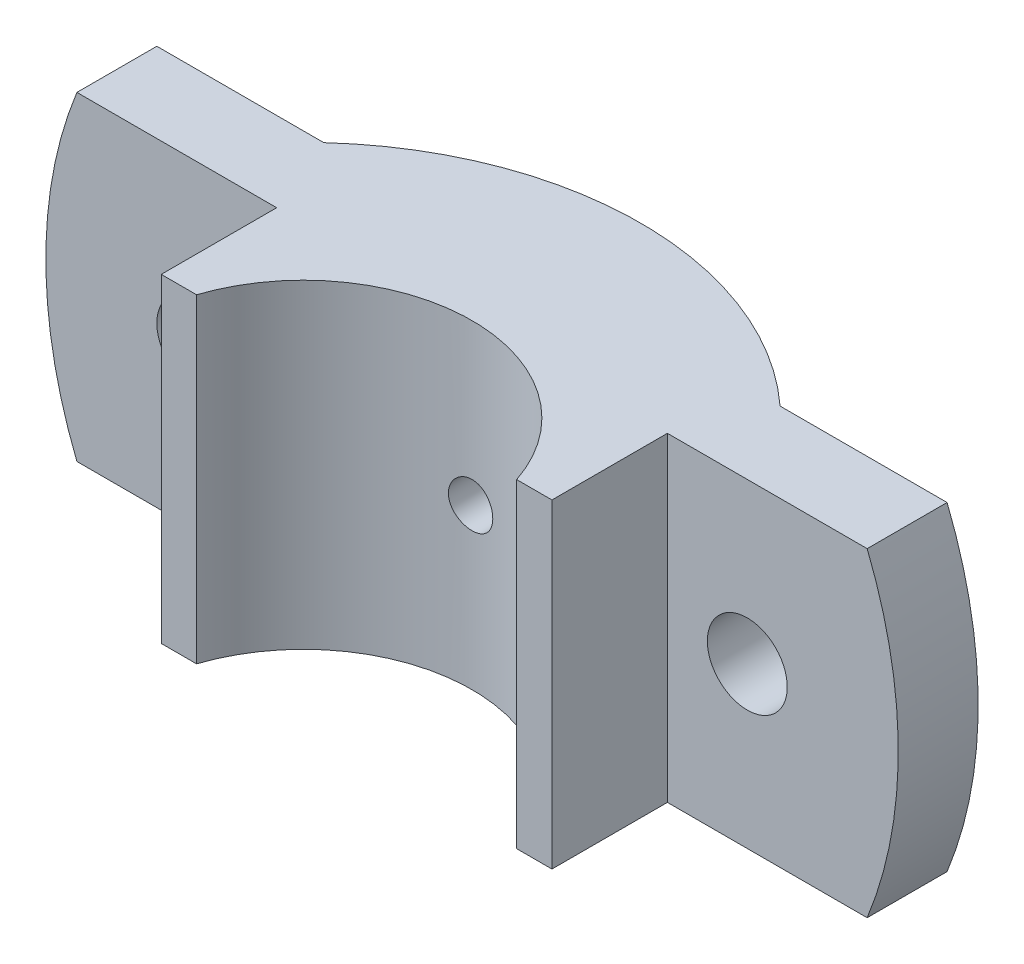
ISO-10303-21;
HEADER;
FILE_DESCRIPTION(('STEP AP214'),'2;1');
FILE_NAME('part.step','',(''),(''),'','','');
FILE_SCHEMA(('AUTOMOTIVE_DESIGN { 1 0 10303 214 1 1 1 1 }'));
ENDSEC;
DATA;
#1=APPLICATION_CONTEXT('core data for automotive mechanical design processes');
#2=APPLICATION_PROTOCOL_DEFINITION('international standard','automotive_design',2000,#1);
#3=PRODUCT_CONTEXT('',#1,'mechanical');
#4=PRODUCT('Part','Part','',(#3));
#5=PRODUCT_RELATED_PRODUCT_CATEGORY('part','',(#4));
#6=PRODUCT_DEFINITION_FORMATION('','',#4);
#7=PRODUCT_DEFINITION_CONTEXT('part definition',#1,'design');
#8=PRODUCT_DEFINITION('design','',#6,#7);
#9=PRODUCT_DEFINITION_SHAPE('','',#8);
#10=(LENGTH_UNIT() NAMED_UNIT(*) SI_UNIT(.MILLI.,.METRE.));
#11=(NAMED_UNIT(*) PLANE_ANGLE_UNIT() SI_UNIT($,.RADIAN.));
#12=(NAMED_UNIT(*) SI_UNIT($,.STERADIAN.) SOLID_ANGLE_UNIT());
#13=UNCERTAINTY_MEASURE_WITH_UNIT(LENGTH_MEASURE(1.E-05),#10,'distance_accuracy_value','');
#14=(GEOMETRIC_REPRESENTATION_CONTEXT(3) GLOBAL_UNCERTAINTY_ASSIGNED_CONTEXT((#13)) GLOBAL_UNIT_ASSIGNED_CONTEXT((#10,
#11,#12)) REPRESENTATION_CONTEXT('',''));
#15=CARTESIAN_POINT('',(0.,0.,0.));
#16=DIRECTION('',(0.,0.,1.));
#17=DIRECTION('',(1.,0.,0.));
#18=AXIS2_PLACEMENT_3D('',#15,#16,#17);
#19=CARTESIAN_POINT('',(0.,18.,0.));
#20=DIRECTION('',(0.,-1.,0.));
#21=DIRECTION('',(0.,0.,-1.));
#22=AXIS2_PLACEMENT_3D('',#19,#20,#21);
#23=CYLINDRICAL_SURFACE('',#22,38.);
#24=CARTESIAN_POINT('',(-2.99999999999999,0.,-37.8813938497516));
#25=CARTESIAN_POINT('',(-2.99999263785231,-0.168229356223722,-37.881395424836));
#26=CARTESIAN_POINT('',(-2.98580184849921,-0.336574006245494,-37.8825265582867));
#27=CARTESIAN_POINT('',(-2.92939974932901,-0.668607649957892,-37.8869289647691));
#28=CARTESIAN_POINT('',(-2.88715648723706,-0.832291112499561,-37.8902026781767));
#29=CARTESIAN_POINT('',(-2.77587681608235,-1.1501452237575,-37.8985171541647));
#30=CARTESIAN_POINT('',(-2.70685535144457,-1.30432112294824,-37.9035569309858));
#31=CARTESIAN_POINT('',(-2.54400458445207,-1.59886160168987,-37.9148344391245));
#32=CARTESIAN_POINT('',(-2.45018067379415,-1.73922917388467,-37.92107191));
#33=CARTESIAN_POINT('',(-2.24015280345187,-2.00253137226757,-37.9340582512773));
#34=CARTESIAN_POINT('',(-2.1239032815472,-2.12542960763649,-37.9408081455451));
#35=CARTESIAN_POINT('',(-1.87242010716811,-2.34999209013841,-37.9540493837728));
#36=CARTESIAN_POINT('',(-1.7371856346283,-2.45165541954577,-37.9605407165486));
#37=CARTESIAN_POINT('',(-1.45135636719248,-2.63098168610704,-37.9725429812434));
#38=CARTESIAN_POINT('',(-1.3007419119018,-2.708613379424,-37.9780526329515));
#39=CARTESIAN_POINT('',(-0.988565369760012,-2.83747282349098,-37.9874597537665));
#40=CARTESIAN_POINT('',(-0.82700345710322,-2.88870099425837,-37.9913572485189));
#41=CARTESIAN_POINT('',(-0.497878390626905,-2.96319512715381,-37.9970937704964));
#42=CARTESIAN_POINT('',(-0.330328567016737,-2.98651964678537,-37.998937107936));
#43=CARTESIAN_POINT('',(0.00631733654750822,-3.0047253592679,-38.0003722094706));
#44=CARTESIAN_POINT('',(0.17541339034767,-2.99960703233397,-37.9999640115795));
#45=CARTESIAN_POINT('',(0.509954787192964,-2.96112032248106,-37.9969456003133));
#46=CARTESIAN_POINT('',(0.67540742527791,-2.92781491240174,-37.9943402955467));
#47=CARTESIAN_POINT('',(0.998366668593192,-2.83399732705022,-37.9872264182713));
#48=CARTESIAN_POINT('',(1.1558732048081,-2.77348491551835,-37.9827178292348));
#49=CARTESIAN_POINT('',(1.45867002090717,-2.62690060373558,-37.9722962502068));
#50=CARTESIAN_POINT('',(1.6039465541759,-2.54080042217035,-37.9663817077167));
#51=CARTESIAN_POINT('',(1.87800944429183,-2.34550517866702,-37.9538131184224));
#52=CARTESIAN_POINT('',(2.00679550141832,-2.23630969705861,-37.9471590581814));
#53=CARTESIAN_POINT('',(2.24458971981856,-1.99756841972296,-37.9338380622355));
#54=CARTESIAN_POINT('',(2.35354296660022,-1.86796791907116,-37.9271711409281));
#55=CARTESIAN_POINT('',(2.54815472752467,-1.59228636571935,-37.9145941321889));
#56=CARTESIAN_POINT('',(2.63381322519709,-1.44620530136698,-37.9086840452923));
#57=CARTESIAN_POINT('',(2.77940144234371,-1.14167162060739,-37.8982886351211));
#58=CARTESIAN_POINT('',(2.83932843779762,-0.98321769646658,-37.8938034627057));
#59=CARTESIAN_POINT('',(2.93171253141031,-0.658454052626347,-37.8867684945926));
#60=CARTESIAN_POINT('',(2.96417014717686,-0.492144481013882,-37.8842186624274));
#61=CARTESIAN_POINT('',(3.00062486955394,-0.15687062958801,-37.8813488492975));
#62=CARTESIAN_POINT('',(3.00469849779479,0.0120852808075245,-37.8810228729924));
#63=CARTESIAN_POINT('',(2.98446993701008,0.348277674479457,-37.8826218486592));
#64=CARTESIAN_POINT('',(2.96016798514648,0.515514172114851,-37.884546781818));
#65=CARTESIAN_POINT('',(2.88394184726827,0.843301603254927,-37.8904252096708));
#66=CARTESIAN_POINT('',(2.83205326228916,1.00386086655318,-37.8943760896121));
#67=CARTESIAN_POINT('',(2.70216294400362,1.31399395677734,-37.9038590548662));
#68=CARTESIAN_POINT('',(2.62416083401247,1.46356762519929,-37.9093911629878));
#69=CARTESIAN_POINT('',(2.44406357833825,1.74783416137562,-37.9214277776749));
#70=CARTESIAN_POINT('',(2.34191737427746,1.88249459296493,-37.9279343341079));
#71=CARTESIAN_POINT('',(2.11650535947003,2.13278456634996,-37.9411797159946));
#72=CARTESIAN_POINT('',(1.99323922217928,2.24841381384239,-37.9479185450382));
#73=CARTESIAN_POINT('',(1.72875604909499,2.45761968980163,-37.9608869464052));
#74=CARTESIAN_POINT('',(1.58749965829181,2.55114664697588,-37.9671153515116));
#75=CARTESIAN_POINT('',(1.29124223392212,2.71315246287969,-37.9783443227055));
#76=CARTESIAN_POINT('',(1.13624132557013,2.78163154976985,-37.9833448999771));
#77=CARTESIAN_POINT('',(0.817073838218853,2.8915121915042,-37.9915493740706));
#78=CARTESIAN_POINT('',(0.652917946506941,2.93294463032733,-37.9947553195452));
#79=CARTESIAN_POINT('',(0.319953232508929,2.98765683143964,-37.999017594232));
#80=CARTESIAN_POINT('',(0.151144488421416,3.00093706657949,-38.0000739595491));
#81=CARTESIAN_POINT('',(-0.185844007724723,2.99896261174756,-37.9999181203354));
#82=CARTESIAN_POINT('',(-0.354024222061248,2.98378540562109,-37.9987120758837));
#83=CARTESIAN_POINT('',(-0.685439460070171,2.92548825985853,-37.9941791393791));
#84=CARTESIAN_POINT('',(-0.848674476485683,2.88236827921959,-37.9908522442141));
#85=CARTESIAN_POINT('',(-1.16557212517757,2.76942883565186,-37.9824510315142));
#86=CARTESIAN_POINT('',(-1.3192351758783,2.69961054075428,-37.9773767904253));
#87=CARTESIAN_POINT('',(-1.61267080850137,2.53526551305572,-37.9660490429656));
#88=CARTESIAN_POINT('',(-1.7524436427022,2.44073922912224,-37.9597955580186));
#89=CARTESIAN_POINT('',(-2.01452730784427,2.22937105364119,-37.9467913112364));
#90=CARTESIAN_POINT('',(-2.13679197870458,2.11247200370349,-37.9400393035084));
#91=CARTESIAN_POINT('',(-2.3600119308789,1.85977604977668,-37.926809547746));
#92=CARTESIAN_POINT('',(-2.46096203215627,1.72397456524185,-37.9203318666858));
#93=CARTESIAN_POINT('',(-2.63880908526894,1.43709086811672,-37.9083720300883));
#94=CARTESIAN_POINT('',(-2.71566430398236,1.28598273615028,-37.9028916086487));
#95=CARTESIAN_POINT('',(-2.84281465262269,0.973068347368229,-37.8935681492736));
#96=CARTESIAN_POINT('',(-2.89314045280836,0.811274688620423,-37.8897232215665));
#97=CARTESIAN_POINT('',(-2.9529242107747,0.540431663186952,-37.8850993601198));
#98=CARTESIAN_POINT('',(-2.97055431578336,0.433126408915519,-37.883716139462));
#99=CARTESIAN_POINT('',(-2.99409457369404,0.217230128113448,-37.8818628767795));
#100=CARTESIAN_POINT('',(-3.00000475432558,0.108639104625571,-37.8813928325941));
#101=CARTESIAN_POINT('',(-2.99999999999999,0.,-37.8813938497516));
#102=B_SPLINE_CURVE_WITH_KNOTS('',3,(#24,#25,#26,#27,#28,#29,#30,#31,#32,#33,#34,#35,#36,#37,
#38,#39,#40,#41,#42,#43,#44,#45,#46,#47,#48,#49,#50,#51,#52,#53,#54,#55,#56,#57,#58,#59,#60,#61,
#62,#63,#64,#65,#66,#67,#68,#69,#70,#71,#72,#73,#74,#75,#76,#77,#78,#79,#80,#81,#82,#83,#84,#85,
#86,#87,#88,#89,#90,#91,#92,#93,#94,#95,#96,#97,#98,#99,#100,#101),.UNSPECIFIED.,.T.,.F.,(4,2,2,
2,2,2,2,2,2,2,2,2,2,2,2,2,2,2,2,2,2,2,2,2,2,2,2,2,2,2,2,2,2,2,2,2,2,2,4),(0.,0.504291421669989,
1.00915822788302,1.51374368152856,2.01821953559138,2.52373134073237,3.02926498845646,
3.53545315301367,4.04163326507021,4.546749253583,5.05185671399058,5.55583868228782,
6.05982502713927,6.56437049631086,7.06892513448829,7.5748562462125,8.08078771565083,
8.58677273143866,9.09274821269729,9.59735908295554,10.1019657357268,10.6059227598395,
11.10988705379,11.6149267875576,12.1199743306602,12.6261463157288,13.1323136899712,
13.6379020669613,14.1434819519092,14.6476872439429,15.1518932758423,15.6560772516295,
16.1602520685946,16.6657325841807,17.1713358046312,17.6778099691558,18.1836973153047,
18.5093592531183,18.8350204204102),.UNSPECIFIED.);
#103=CARTESIAN_POINT('',(-2.99999999999999,0.,-37.8813938497516));
#104=VERTEX_POINT('',#103);
#105=EDGE_CURVE('E11',#104,#104,#102,.T.);
#106=ORIENTED_EDGE('',*,*,#105,.T.);
#107=EDGE_LOOP('',(#106));
#108=FACE_BOUND('',#107,.T.);
#109=DIRECTION('',(0.,-1.,0.));
#110=VECTOR('',#109,1.);
#111=CARTESIAN_POINT('',(25.6904651573303,18.,-28.));
#112=LINE('',#111,#110);
#113=CARTESIAN_POINT('',(25.6904651573303,18.,-28.));
#114=VERTEX_POINT('',#113);
#115=CARTESIAN_POINT('',(25.6904651573303,6.6376833123068,-28.));
#116=VERTEX_POINT('',#115);
#117=EDGE_CURVE('E148',#114,#116,#112,.T.);
#118=ORIENTED_EDGE('',*,*,#117,.T.);
#119=CARTESIAN_POINT('',(25.6904651573303,-6.63768331230681,-28.));
#120=CARTESIAN_POINT('',(25.5360851043424,-6.51420867249738,-28.1416681018721));
#121=CARTESIAN_POINT('',(25.3836215551735,-6.38340380017069,-28.2791823336498));
#122=CARTESIAN_POINT('',(25.0841053598261,-6.10685950724572,-28.5451833866574));
#123=CARTESIAN_POINT('',(24.9370580895264,-5.96110576476095,-28.6736613482156));
#124=CARTESIAN_POINT('',(24.6491941230388,-5.65349144226202,-28.9215085426632));
#125=CARTESIAN_POINT('',(24.508431723833,-5.49151942353941,-29.0408031542341));
#126=CARTESIAN_POINT('',(24.2363075607749,-5.15263687836671,-29.2682904084011));
#127=CARTESIAN_POINT('',(24.1049430857226,-4.97573069263073,-29.3764862568107));
#128=CARTESIAN_POINT('',(23.8528205053459,-4.60631493821574,-29.5815743674557));
#129=CARTESIAN_POINT('',(23.7321338833277,-4.41371469093336,-29.6783916917415));
#130=CARTESIAN_POINT('',(23.5043908446779,-4.01479632179466,-29.85908164754));
#131=CARTESIAN_POINT('',(23.3973358972541,-3.80847672492271,-29.942952883943));
#132=CARTESIAN_POINT('',(23.1992536300817,-3.38422419101506,-30.0966827286364));
#133=CARTESIAN_POINT('',(23.1081729651954,-3.16633319991272,-30.1665880882949));
#134=CARTESIAN_POINT('',(22.9434688496595,-2.72008092153076,-30.2920447623401));
#135=CARTESIAN_POINT('',(22.869842066784,-2.49172164276595,-30.347598816803));
#136=CARTESIAN_POINT('',(22.7499342032062,-2.05682098381957,-30.4375648556656));
#137=CARTESIAN_POINT('',(22.7013462567531,-1.85128534823193,-30.4737833576563));
#138=CARTESIAN_POINT('',(22.6194172898017,-1.43551725204116,-30.534645499234));
#139=CARTESIAN_POINT('',(22.5860747992536,-1.22528524633892,-30.5592902548309));
#140=CARTESIAN_POINT('',(22.5352129551669,-0.80179959149854,-30.5968164834569));
#141=CARTESIAN_POINT('',(22.5176992505084,-0.588544891193934,-30.6096937569973));
#142=CARTESIAN_POINT('',(22.4988301660851,-0.160939560666245,-30.6235658271181));
#143=CARTESIAN_POINT('',(22.4974739036633,0.0534110090511226,-30.624561272785));
#144=CARTESIAN_POINT('',(22.5103301119086,0.46199747981814,-30.6151119876343));
#145=CARTESIAN_POINT('',(22.5231488228924,0.656303160135766,-30.6056914251709));
#146=CARTESIAN_POINT('',(22.5619809221014,1.0428625929884,-30.5770763766543));
#147=CARTESIAN_POINT('',(22.5879939672906,1.23511639873688,-30.5578821447042));
#148=CARTESIAN_POINT('',(22.6528192304938,1.61613906729809,-30.5098574663833));
#149=CARTESIAN_POINT('',(22.6916259266854,1.80490939654948,-30.4810311771979));
#150=CARTESIAN_POINT('',(22.7814851533843,2.17779604427593,-30.4139289484325));
#151=CARTESIAN_POINT('',(22.8325379785097,2.36191225066402,-30.3756527815061));
#152=CARTESIAN_POINT('',(22.9463727274414,2.72495933677602,-30.2897519777021));
#153=CARTESIAN_POINT('',(23.0091940590921,2.90387039063446,-30.2420959034169));
#154=CARTESIAN_POINT('',(23.1456283742011,3.25489148863349,-30.1378044455699));
#155=CARTESIAN_POINT('',(23.2192449894415,3.42699921914349,-30.0811660396201));
#156=CARTESIAN_POINT('',(23.3763137314078,3.76349373210636,-29.9592695660632));
#157=CARTESIAN_POINT('',(23.4597660818508,3.92788033882065,-29.8940113023904));
#158=CARTESIAN_POINT('',(23.6355270453779,4.24828704232642,-29.7552415450916));
#159=CARTESIAN_POINT('',(23.7278387953854,4.40430414494655,-29.6817271265587));
#160=CARTESIAN_POINT('',(23.9282386479047,4.71995510834892,-29.5204551498758));
#161=CARTESIAN_POINT('',(24.0370002176616,4.87881602386906,-29.432022004933));
#162=CARTESIAN_POINT('',(24.2623844714665,5.1856332961988,-29.2465042091278));
#163=CARTESIAN_POINT('',(24.379010630913,5.33358477081362,-29.1494157272481));
#164=CARTESIAN_POINT('',(24.6187042069683,5.61815393006347,-28.9472618083659));
#165=CARTESIAN_POINT('',(24.7417672458198,5.75477915839728,-28.8422017715012));
#166=CARTESIAN_POINT('',(24.9931857635631,6.01673825944901,-28.6246099475779));
#167=CARTESIAN_POINT('',(25.121541230047,6.14207215863705,-28.5120781780363));
#168=CARTESIAN_POINT('',(25.3239635142993,6.32788833390874,-28.3320696328102));
#169=CARTESIAN_POINT('',(25.3966039536003,6.39227987552886,-28.2669811541268));
#170=CARTESIAN_POINT('',(25.5428336292653,6.5175597465675,-28.1349133065772));
#171=CARTESIAN_POINT('',(25.6164208573993,6.57845434819236,-28.0679376662269));
#172=CARTESIAN_POINT('',(25.6904651573302,6.63768331230707,-28.0000000000002));
#173=B_SPLINE_CURVE_WITH_KNOTS('',3,(#119,#120,#121,#122,#123,#124,#125,#126,#127,#128,#129,
#130,#131,#132,#133,#134,#135,#136,#137,#138,#139,#140,#141,#142,#143,#144,#145,#146,#147,#148,
#149,#150,#151,#152,#153,#154,#155,#156,#157,#158,#159,#160,#161,#162,#163,#164,#165,#166,#167,
#168,#169,#170,#171,#172),.UNSPECIFIED.,.F.,.F.,(4,2,2,2,2,2,2,2,2,2,2,2,2,2,2,2,2,2,2,2,2,2,2,
2,2,2,4),(0.,0.729592400834077,1.45989044138352,2.19560470883999,2.93110586753776,
3.671207635528,4.41138910352644,5.14904966030399,5.88656927223682,6.52855006409987,
7.17046893961491,7.81261680885223,8.45472959834448,9.03890309081735,9.62306139629817,
10.2069679046447,10.7908884620572,11.3768004587137,11.9629100238154,12.549032922753,
13.1353641263273,13.7703169673958,14.4055522594534,15.0403610040221,15.6751682603777,
16.0257258218314,16.3756336015193),.UNSPECIFIED.);
#174=CARTESIAN_POINT('',(25.6904651573303,-6.6376833123068,-28.));
#175=VERTEX_POINT('',#174);
#176=EDGE_CURVE('E140',#175,#116,#173,.T.);
#177=ORIENTED_EDGE('',*,*,#176,.F.);
#178=CARTESIAN_POINT('',(25.6904651573303,-18.,-28.));
#179=VERTEX_POINT('',#178);
#180=EDGE_CURVE('E145',#175,#179,#112,.T.);
#181=ORIENTED_EDGE('',*,*,#180,.T.);
#182=CARTESIAN_POINT('',(0.,-18.,0.));
#183=DIRECTION('',(0.,1.,0.));
#184=DIRECTION('',(0.,0.,1.));
#185=AXIS2_PLACEMENT_3D('',#182,#183,#184);
#186=CIRCLE('',#185,38.);
#187=CARTESIAN_POINT('',(-25.6904651573303,-18.,-28.));
#188=VERTEX_POINT('',#187);
#189=EDGE_CURVE('E433',#179,#188,#186,.T.);
#190=ORIENTED_EDGE('',*,*,#189,.T.);
#191=DIRECTION('',(0.,-1.,0.));
#192=VECTOR('',#191,1.);
#193=CARTESIAN_POINT('',(-25.6904651573303,18.,-28.));
#194=LINE('',#193,#192);
#195=CARTESIAN_POINT('',(-25.6904651573303,-6.6376833123068,-28.));
#196=VERTEX_POINT('',#195);
#197=EDGE_CURVE('E159',#196,#188,#194,.T.);
#198=ORIENTED_EDGE('',*,*,#197,.F.);
#199=CARTESIAN_POINT('',(-25.6904651573303,-6.6376833123068,-28.));
#200=CARTESIAN_POINT('',(-25.5360851043424,-6.51420867249737,-28.1416681018721));
#201=CARTESIAN_POINT('',(-25.3836215551735,-6.38340380017068,-28.2791823336498));
#202=CARTESIAN_POINT('',(-25.0841053598261,-6.10685950724571,-28.5451833866574));
#203=CARTESIAN_POINT('',(-24.9370580895264,-5.96110576476094,-28.6736613482156));
#204=CARTESIAN_POINT('',(-24.6491941230388,-5.65349144226201,-28.9215085426633));
#205=CARTESIAN_POINT('',(-24.508431723833,-5.4915194235394,-29.0408031542341));
#206=CARTESIAN_POINT('',(-24.2363075607749,-5.1526368783667,-29.2682904084011));
#207=CARTESIAN_POINT('',(-24.1049430857226,-4.97573069263072,-29.3764862568107));
#208=CARTESIAN_POINT('',(-23.8528205053459,-4.60631493821573,-29.5815743674557));
#209=CARTESIAN_POINT('',(-23.7321338833277,-4.41371469093335,-29.6783916917415));
#210=CARTESIAN_POINT('',(-23.5043908446779,-4.01479632179465,-29.85908164754));
#211=CARTESIAN_POINT('',(-23.3973358972541,-3.8084767249227,-29.942952883943));
#212=CARTESIAN_POINT('',(-23.1992536300817,-3.38422419101505,-30.0966827286364));
#213=CARTESIAN_POINT('',(-23.1081729651954,-3.16633319991271,-30.1665880882949));
#214=CARTESIAN_POINT('',(-22.9434688496595,-2.72008092153075,-30.2920447623401));
#215=CARTESIAN_POINT('',(-22.869842066784,-2.49172164276594,-30.347598816803));
#216=CARTESIAN_POINT('',(-22.7499342032062,-2.05682098381957,-30.4375648556656));
#217=CARTESIAN_POINT('',(-22.7013462567531,-1.85128534823192,-30.4737833576563));
#218=CARTESIAN_POINT('',(-22.6194172898017,-1.43551725204116,-30.534645499234));
#219=CARTESIAN_POINT('',(-22.5860747992536,-1.22528524633892,-30.5592902548309));
#220=CARTESIAN_POINT('',(-22.5352129551669,-0.801799591498538,-30.5968164834569));
#221=CARTESIAN_POINT('',(-22.5176992505084,-0.588544891193932,-30.6096937569973));
#222=CARTESIAN_POINT('',(-22.4988301660851,-0.160939560666243,-30.6235658271181));
#223=CARTESIAN_POINT('',(-22.4974739036633,0.053411009051124,-30.624561272785));
#224=CARTESIAN_POINT('',(-22.5103301119086,0.461997479818141,-30.6151119876343));
#225=CARTESIAN_POINT('',(-22.5231488228924,0.656303160135767,-30.6056914251709));
#226=CARTESIAN_POINT('',(-22.5619809221014,1.0428625929884,-30.5770763766543));
#227=CARTESIAN_POINT('',(-22.5879939672906,1.23511639873688,-30.5578821447042));
#228=CARTESIAN_POINT('',(-22.6528192304938,1.61613906729809,-30.5098574663833));
#229=CARTESIAN_POINT('',(-22.6916259266854,1.80490939654948,-30.4810311771979));
#230=CARTESIAN_POINT('',(-22.7814851533843,2.17779604427593,-30.4139289484325));
#231=CARTESIAN_POINT('',(-22.8325379785097,2.36191225066402,-30.3756527815061));
#232=CARTESIAN_POINT('',(-22.9463727274414,2.72495933677602,-30.2897519777021));
#233=CARTESIAN_POINT('',(-23.0091940590921,2.90387039063446,-30.2420959034169));
#234=CARTESIAN_POINT('',(-23.1456283742011,3.25489148863349,-30.1378044455699));
#235=CARTESIAN_POINT('',(-23.2192449894415,3.42699921914349,-30.0811660396201));
#236=CARTESIAN_POINT('',(-23.3763137314078,3.76349373210636,-29.9592695660632));
#237=CARTESIAN_POINT('',(-23.4597660818508,3.92788033882065,-29.8940113023904));
#238=CARTESIAN_POINT('',(-23.6355270453779,4.24828704232642,-29.7552415450916));
#239=CARTESIAN_POINT('',(-23.7278387953854,4.40430414494655,-29.6817271265587));
#240=CARTESIAN_POINT('',(-23.9282386479047,4.71995510834891,-29.5204551498758));
#241=CARTESIAN_POINT('',(-24.0370002176616,4.87881602386905,-29.4320220049331));
#242=CARTESIAN_POINT('',(-24.2623844714665,5.1856332961988,-29.2465042091278));
#243=CARTESIAN_POINT('',(-24.379010630913,5.33358477081362,-29.1494157272481));
#244=CARTESIAN_POINT('',(-24.6187042069683,5.61815393006346,-28.9472618083659));
#245=CARTESIAN_POINT('',(-24.7417672458198,5.75477915839727,-28.8422017715012));
#246=CARTESIAN_POINT('',(-24.9931857635631,6.016738259449,-28.6246099475779));
#247=CARTESIAN_POINT('',(-25.121541230047,6.14207215863705,-28.5120781780363));
#248=CARTESIAN_POINT('',(-25.3239635142993,6.32788833390874,-28.3320696328102));
#249=CARTESIAN_POINT('',(-25.3966039536003,6.39227987552886,-28.2669811541268));
#250=CARTESIAN_POINT('',(-25.5428336292653,6.51755974656751,-28.1349133065772));
#251=CARTESIAN_POINT('',(-25.6164208573994,6.57845434819237,-28.0679376662269));
#252=CARTESIAN_POINT('',(-25.6904651573302,6.63768331230707,-28.0000000000002));
#253=B_SPLINE_CURVE_WITH_KNOTS('',3,(#199,#200,#201,#202,#203,#204,#205,#206,#207,#208,#209,
#210,#211,#212,#213,#214,#215,#216,#217,#218,#219,#220,#221,#222,#223,#224,#225,#226,#227,#228,
#229,#230,#231,#232,#233,#234,#235,#236,#237,#238,#239,#240,#241,#242,#243,#244,#245,#246,#247,
#248,#249,#250,#251,#252),.UNSPECIFIED.,.F.,.F.,(4,2,2,2,2,2,2,2,2,2,2,2,2,2,2,2,2,2,2,2,2,2,2,
2,2,2,4),(0.,0.729592400834071,1.45989044138351,2.19560470883998,2.93110586753775,
3.67120763552798,4.41138910352643,5.14904966030397,5.8865692722368,6.52855006409985,
7.17046893961489,7.81261680885221,8.45472959834446,9.03890309081733,9.62306139629815,
10.2069679046447,10.7908884620571,11.3768004587137,11.9629100238154,12.549032922753,
13.1353641263273,13.7703169673958,14.4055522594533,15.040361004022,15.6751682603777,
16.0257258218313,16.3756336015193),.UNSPECIFIED.);
#254=CARTESIAN_POINT('',(-25.6904651573303,6.6376833123068,-28.));
#255=VERTEX_POINT('',#254);
#256=EDGE_CURVE('E521',#196,#255,#253,.T.);
#257=ORIENTED_EDGE('',*,*,#256,.T.);
#258=CARTESIAN_POINT('',(-25.6904651573303,18.,-28.));
#259=VERTEX_POINT('',#258);
#260=EDGE_CURVE('E155',#259,#255,#194,.T.);
#261=ORIENTED_EDGE('',*,*,#260,.F.);
#262=CARTESIAN_POINT('',(0.,18.,0.));
#263=DIRECTION('',(0.,1.,0.));
#264=DIRECTION('',(0.,0.,1.));
#265=AXIS2_PLACEMENT_3D('',#262,#263,#264);
#266=CIRCLE('',#265,38.);
#267=EDGE_CURVE('E483',#114,#259,#266,.T.);
#268=ORIENTED_EDGE('',*,*,#267,.F.);
#269=EDGE_LOOP('',(#118,#177,#181,#190,#198,#257,#261,#268));
#270=FACE_BOUND('',#269,.T.);
#271=ADVANCED_FACE('F33',(#108,#270),#23,.T.);
#272=CARTESIAN_POINT('',(0.,18.,0.));
#273=DIRECTION('',(0.,-1.,0.));
#274=DIRECTION('',(0.,0.,-1.));
#275=AXIS2_PLACEMENT_3D('',#272,#273,#274);
#276=PLANE('',#275);
#277=DIRECTION('',(0.,0.,-1.));
#278=VECTOR('',#277,1.);
#279=CARTESIAN_POINT('',(44.497190922574,18.,-5.99999999999997));
#280=LINE('',#279,#278);
#281=CARTESIAN_POINT('',(44.497190922574,18.,-19.));
#282=VERTEX_POINT('',#281);
#283=CARTESIAN_POINT('',(44.497190922574,18.,-28.));
#284=VERTEX_POINT('',#283);
#285=EDGE_CURVE('E501',#282,#284,#280,.T.);
#286=ORIENTED_EDGE('',*,*,#285,.T.);
#287=DIRECTION('',(-1.,0.,0.));
#288=VECTOR('',#287,1.);
#289=CARTESIAN_POINT('',(50.,18.,-28.));
#290=LINE('',#289,#288);
#291=EDGE_CURVE('E481',#284,#114,#290,.T.);
#292=ORIENTED_EDGE('',*,*,#291,.T.);
#293=ORIENTED_EDGE('',*,*,#267,.T.);
#294=DIRECTION('',(-1.,0.,0.));
#295=VECTOR('',#294,1.);
#296=CARTESIAN_POINT('',(-50.,18.,-28.));
#297=LINE('',#296,#295);
#298=CARTESIAN_POINT('',(-44.497190922574,18.,-28.));
#299=VERTEX_POINT('',#298);
#300=EDGE_CURVE('E485',#259,#299,#297,.T.);
#301=ORIENTED_EDGE('',*,*,#300,.T.);
#302=DIRECTION('',(0.,0.,-1.));
#303=VECTOR('',#302,1.);
#304=CARTESIAN_POINT('',(-44.497190922574,18.,-6.));
#305=LINE('',#304,#303);
#306=CARTESIAN_POINT('',(-44.497190922574,18.,-19.));
#307=VERTEX_POINT('',#306);
#308=EDGE_CURVE('E464',#307,#299,#305,.T.);
#309=ORIENTED_EDGE('',*,*,#308,.F.);
#310=DIRECTION('',(1.,0.,0.));
#311=VECTOR('',#310,1.);
#312=CARTESIAN_POINT('',(-22.,18.,-19.));
#313=LINE('',#312,#311);
#314=CARTESIAN_POINT('',(-22.,18.,-19.));
#315=VERTEX_POINT('',#314);
#316=EDGE_CURVE('E463',#307,#315,#313,.T.);
#317=ORIENTED_EDGE('',*,*,#316,.T.);
#318=DIRECTION('',(0.,0.,1.));
#319=VECTOR('',#318,1.);
#320=CARTESIAN_POINT('',(-22.,18.,-6.));
#321=LINE('',#320,#319);
#322=CARTESIAN_POINT('',(-22.,18.,-6.));
#323=VERTEX_POINT('',#322);
#324=EDGE_CURVE('E488',#315,#323,#321,.T.);
#325=ORIENTED_EDGE('',*,*,#324,.T.);
#326=DIRECTION('',(1.,0.,0.));
#327=VECTOR('',#326,1.);
#328=CARTESIAN_POINT('',(-18.0277563773199,18.,-6.));
#329=LINE('',#328,#327);
#330=CARTESIAN_POINT('',(-18.0277563773199,18.,-6.));
#331=VERTEX_POINT('',#330);
#332=EDGE_CURVE('E425',#323,#331,#329,.T.);
#333=ORIENTED_EDGE('',*,*,#332,.T.);
#334=CARTESIAN_POINT('',(0.,18.,0.));
#335=DIRECTION('',(0.,-1.,0.));
#336=DIRECTION('',(0.,0.,-1.));
#337=AXIS2_PLACEMENT_3D('',#334,#335,#336);
#338=CIRCLE('',#337,19.);
#339=CARTESIAN_POINT('',(18.0277563773199,18.,-6.));
#340=VERTEX_POINT('',#339);
#341=EDGE_CURVE('E444',#331,#340,#338,.T.);
#342=ORIENTED_EDGE('',*,*,#341,.T.);
#343=DIRECTION('',(1.,0.,0.));
#344=VECTOR('',#343,1.);
#345=CARTESIAN_POINT('',(18.0277563773199,18.,-6.));
#346=LINE('',#345,#344);
#347=CARTESIAN_POINT('',(22.,18.,-6.));
#348=VERTEX_POINT('',#347);
#349=EDGE_CURVE('E474',#340,#348,#346,.T.);
#350=ORIENTED_EDGE('',*,*,#349,.T.);
#351=DIRECTION('',(0.,0.,-1.));
#352=VECTOR('',#351,1.);
#353=CARTESIAN_POINT('',(22.,18.,-6.));
#354=LINE('',#353,#352);
#355=CARTESIAN_POINT('',(22.,18.,-19.));
#356=VERTEX_POINT('',#355);
#357=EDGE_CURVE('E476',#348,#356,#354,.T.);
#358=ORIENTED_EDGE('',*,*,#357,.T.);
#359=DIRECTION('',(1.,0.,0.));
#360=VECTOR('',#359,1.);
#361=CARTESIAN_POINT('',(22.,18.,-19.));
#362=LINE('',#361,#360);
#363=EDGE_CURVE('E478',#356,#282,#362,.T.);
#364=ORIENTED_EDGE('',*,*,#363,.T.);
#365=EDGE_LOOP('',(#286,#292,#293,#301,#309,#317,#325,#333,#342,#350,#358,#364));
#366=FACE_BOUND('',#365,.T.);
#367=ADVANCED_FACE('F222',(#366),#276,.F.);
#368=CARTESIAN_POINT('',(0.,-18.,0.));
#369=DIRECTION('',(0.,-1.,0.));
#370=DIRECTION('',(0.,0.,-1.));
#371=AXIS2_PLACEMENT_3D('',#368,#369,#370);
#372=PLANE('',#371);
#373=DIRECTION('',(-1.,0.,0.));
#374=VECTOR('',#373,1.);
#375=CARTESIAN_POINT('',(50.,-18.,-28.));
#376=LINE('',#375,#374);
#377=CARTESIAN_POINT('',(44.497190922574,-18.,-28.));
#378=VERTEX_POINT('',#377);
#379=EDGE_CURVE('E153',#378,#179,#376,.T.);
#380=ORIENTED_EDGE('',*,*,#379,.F.);
#381=DIRECTION('',(0.,0.,-1.));
#382=VECTOR('',#381,1.);
#383=CARTESIAN_POINT('',(44.497190922574,-18.,-5.99999999999997));
#384=LINE('',#383,#382);
#385=CARTESIAN_POINT('',(44.497190922574,-18.,-19.));
#386=VERTEX_POINT('',#385);
#387=EDGE_CURVE('E503',#386,#378,#384,.T.);
#388=ORIENTED_EDGE('',*,*,#387,.F.);
#389=DIRECTION('',(1.,0.,0.));
#390=VECTOR('',#389,1.);
#391=CARTESIAN_POINT('',(22.,-18.,-19.));
#392=LINE('',#391,#390);
#393=CARTESIAN_POINT('',(22.,-18.,-19.));
#394=VERTEX_POINT('',#393);
#395=EDGE_CURVE('E429',#394,#386,#392,.T.);
#396=ORIENTED_EDGE('',*,*,#395,.F.);
#397=DIRECTION('',(0.,0.,-1.));
#398=VECTOR('',#397,1.);
#399=CARTESIAN_POINT('',(22.,-18.,-6.));
#400=LINE('',#399,#398);
#401=CARTESIAN_POINT('',(22.,-18.,-6.));
#402=VERTEX_POINT('',#401);
#403=EDGE_CURVE('E420',#402,#394,#400,.T.);
#404=ORIENTED_EDGE('',*,*,#403,.F.);
#405=DIRECTION('',(1.,0.,0.));
#406=VECTOR('',#405,1.);
#407=CARTESIAN_POINT('',(18.0277563773199,-18.,-6.));
#408=LINE('',#407,#406);
#409=CARTESIAN_POINT('',(18.0277563773199,-18.,-6.));
#410=VERTEX_POINT('',#409);
#411=EDGE_CURVE('E417',#410,#402,#408,.T.);
#412=ORIENTED_EDGE('',*,*,#411,.F.);
#413=CARTESIAN_POINT('',(0.,-18.,0.));
#414=DIRECTION('',(0.,-1.,0.));
#415=DIRECTION('',(0.,0.,-1.));
#416=AXIS2_PLACEMENT_3D('',#413,#414,#415);
#417=CIRCLE('',#416,19.);
#418=CARTESIAN_POINT('',(-18.0277563773199,-18.,-6.));
#419=VERTEX_POINT('',#418);
#420=EDGE_CURVE('E412',#419,#410,#417,.T.);
#421=ORIENTED_EDGE('',*,*,#420,.F.);
#422=DIRECTION('',(1.,0.,0.));
#423=VECTOR('',#422,1.);
#424=CARTESIAN_POINT('',(-18.0277563773199,-18.,-6.));
#425=LINE('',#424,#423);
#426=CARTESIAN_POINT('',(-22.,-18.,-6.));
#427=VERTEX_POINT('',#426);
#428=EDGE_CURVE('E442',#427,#419,#425,.T.);
#429=ORIENTED_EDGE('',*,*,#428,.F.);
#430=DIRECTION('',(0.,0.,1.));
#431=VECTOR('',#430,1.);
#432=CARTESIAN_POINT('',(-22.,-18.,-6.));
#433=LINE('',#432,#431);
#434=CARTESIAN_POINT('',(-22.,-18.,-19.));
#435=VERTEX_POINT('',#434);
#436=EDGE_CURVE('E440',#435,#427,#433,.T.);
#437=ORIENTED_EDGE('',*,*,#436,.F.);
#438=DIRECTION('',(1.,0.,0.));
#439=VECTOR('',#438,1.);
#440=CARTESIAN_POINT('',(-22.,-18.,-19.));
#441=LINE('',#440,#439);
#442=CARTESIAN_POINT('',(-44.497190922574,-18.,-19.));
#443=VERTEX_POINT('',#442);
#444=EDGE_CURVE('E438',#443,#435,#441,.T.);
#445=ORIENTED_EDGE('',*,*,#444,.F.);
#446=DIRECTION('',(0.,0.,-1.));
#447=VECTOR('',#446,1.);
#448=CARTESIAN_POINT('',(-44.497190922574,-18.,-6.));
#449=LINE('',#448,#447);
#450=CARTESIAN_POINT('',(-44.497190922574,-18.,-28.));
#451=VERTEX_POINT('',#450);
#452=EDGE_CURVE('E46',#443,#451,#449,.T.);
#453=ORIENTED_EDGE('',*,*,#452,.T.);
#454=DIRECTION('',(-1.,0.,0.));
#455=VECTOR('',#454,1.);
#456=CARTESIAN_POINT('',(-50.,-18.,-28.));
#457=LINE('',#456,#455);
#458=EDGE_CURVE('E435',#188,#451,#457,.T.);
#459=ORIENTED_EDGE('',*,*,#458,.F.);
#460=ORIENTED_EDGE('',*,*,#189,.F.);
#461=EDGE_LOOP('',(#380,#388,#396,#404,#412,#421,#429,#437,#445,#453,#459,#460));
#462=FACE_BOUND('',#461,.T.);
#463=ADVANCED_FACE('F225',(#462),#372,.T.);
#464=CARTESIAN_POINT('',(22.,18.,-19.));
#465=DIRECTION('',(0.,0.,-1.));
#466=DIRECTION('',(-1.,0.,0.));
#467=AXIS2_PLACEMENT_3D('',#464,#465,#466);
#468=PLANE('',#467);
#469=CARTESIAN_POINT('',(31.,0.,-19.));
#470=DIRECTION('',(0.,0.,-1.));
#471=DIRECTION('',(-1.,0.,0.));
#472=AXIS2_PLACEMENT_3D('',#469,#470,#471);
#473=CIRCLE('',#472,4.5);
#474=CARTESIAN_POINT('',(26.5,0.,-19.));
#475=VERTEX_POINT('',#474);
#476=EDGE_CURVE('E418',#475,#475,#473,.T.);
#477=ORIENTED_EDGE('',*,*,#476,.T.);
#478=EDGE_LOOP('',(#477));
#479=FACE_BOUND('',#478,.T.);
#480=CARTESIAN_POINT('',(0.,0.,-19.));
#481=DIRECTION('',(0.,0.,-1.));
#482=DIRECTION('',(-1.,0.,0.));
#483=AXIS2_PLACEMENT_3D('',#480,#481,#482);
#484=CIRCLE('',#483,48.);
#485=EDGE_CURVE('E500',#282,#386,#484,.T.);
#486=ORIENTED_EDGE('',*,*,#485,.F.);
#487=ORIENTED_EDGE('',*,*,#363,.F.);
#488=DIRECTION('',(0.,-1.,0.));
#489=VECTOR('',#488,1.);
#490=CARTESIAN_POINT('',(22.,18.,-19.));
#491=LINE('',#490,#489);
#492=EDGE_CURVE('E157',#356,#394,#491,.T.);
#493=ORIENTED_EDGE('',*,*,#492,.T.);
#494=ORIENTED_EDGE('',*,*,#395,.T.);
#495=EDGE_LOOP('',(#486,#487,#493,#494));
#496=FACE_BOUND('',#495,.T.);
#497=ADVANCED_FACE('F229',(#479,#496),#468,.F.);
#498=CARTESIAN_POINT('',(50.,18.,-28.));
#499=DIRECTION('',(0.,0.,1.));
#500=DIRECTION('',(1.,0.,0.));
#501=AXIS2_PLACEMENT_3D('',#498,#499,#500);
#502=PLANE('',#501);
#503=CARTESIAN_POINT('',(31.,0.,-28.));
#504=DIRECTION('',(0.,0.,-1.));
#505=DIRECTION('',(-1.,0.,0.));
#506=AXIS2_PLACEMENT_3D('',#503,#504,#505);
#507=CIRCLE('',#506,4.5);
#508=CARTESIAN_POINT('',(26.5,0.,-28.));
#509=VERTEX_POINT('',#508);
#510=EDGE_CURVE('E174',#509,#509,#507,.T.);
#511=ORIENTED_EDGE('',*,*,#510,.F.);
#512=EDGE_LOOP('',(#511));
#513=FACE_BOUND('',#512,.T.);
#514=CARTESIAN_POINT('',(0.,0.,-28.));
#515=DIRECTION('',(0.,0.,-1.));
#516=DIRECTION('',(-1.,0.,0.));
#517=AXIS2_PLACEMENT_3D('',#514,#515,#516);
#518=CIRCLE('',#517,48.);
#519=EDGE_CURVE('E504',#284,#378,#518,.T.);
#520=ORIENTED_EDGE('',*,*,#519,.T.);
#521=ORIENTED_EDGE('',*,*,#379,.T.);
#522=ORIENTED_EDGE('',*,*,#180,.F.);
#523=CARTESIAN_POINT('',(31.,0.,-28.));
#524=DIRECTION('',(0.,0.,1.));
#525=DIRECTION('',(1.,0.,0.));
#526=AXIS2_PLACEMENT_3D('',#523,#524,#525);
#527=CIRCLE('',#526,8.50000000000001);
#528=EDGE_CURVE('E53',#116,#175,#527,.T.);
#529=ORIENTED_EDGE('',*,*,#528,.F.);
#530=ORIENTED_EDGE('',*,*,#117,.F.);
#531=ORIENTED_EDGE('',*,*,#291,.F.);
#532=EDGE_LOOP('',(#520,#521,#522,#529,#530,#531));
#533=FACE_BOUND('',#532,.T.);
#534=ADVANCED_FACE('F151',(#513,#533),#502,.F.);
#535=CARTESIAN_POINT('',(-50.,18.,-28.));
#536=DIRECTION('',(0.,0.,1.));
#537=DIRECTION('',(1.,0.,0.));
#538=AXIS2_PLACEMENT_3D('',#535,#536,#537);
#539=PLANE('',#538);
#540=CARTESIAN_POINT('',(-31.,0.,-28.));
#541=DIRECTION('',(0.,0.,1.));
#542=DIRECTION('',(1.,0.,0.));
#543=AXIS2_PLACEMENT_3D('',#540,#541,#542);
#544=CIRCLE('',#543,4.5);
#545=CARTESIAN_POINT('',(-26.5,0.,-28.));
#546=VERTEX_POINT('',#545);
#547=EDGE_CURVE('E175',#546,#546,#544,.T.);
#548=ORIENTED_EDGE('',*,*,#547,.T.);
#549=EDGE_LOOP('',(#548));
#550=FACE_BOUND('',#549,.T.);
#551=CARTESIAN_POINT('',(0.,0.,-28.));
#552=DIRECTION('',(0.,0.,-1.));
#553=DIRECTION('',(-1.,0.,0.));
#554=AXIS2_PLACEMENT_3D('',#551,#552,#553);
#555=CIRCLE('',#554,48.);
#556=EDGE_CURVE('E460',#451,#299,#555,.T.);
#557=ORIENTED_EDGE('',*,*,#556,.T.);
#558=ORIENTED_EDGE('',*,*,#300,.F.);
#559=ORIENTED_EDGE('',*,*,#260,.T.);
#560=CARTESIAN_POINT('',(-31.,0.,-28.));
#561=DIRECTION('',(0.,0.,-1.));
#562=DIRECTION('',(-1.,0.,0.));
#563=AXIS2_PLACEMENT_3D('',#560,#561,#562);
#564=CIRCLE('',#563,8.50000000000001);
#565=EDGE_CURVE('E60',#255,#196,#564,.T.);
#566=ORIENTED_EDGE('',*,*,#565,.T.);
#567=ORIENTED_EDGE('',*,*,#197,.T.);
#568=ORIENTED_EDGE('',*,*,#458,.T.);
#569=EDGE_LOOP('',(#557,#558,#559,#566,#567,#568));
#570=FACE_BOUND('',#569,.T.);
#571=ADVANCED_FACE('F241',(#550,#570),#539,.F.);
#572=CARTESIAN_POINT('',(-22.,18.,-19.));
#573=DIRECTION('',(0.,0.,-1.));
#574=DIRECTION('',(-1.,0.,0.));
#575=AXIS2_PLACEMENT_3D('',#572,#573,#574);
#576=PLANE('',#575);
#577=CARTESIAN_POINT('',(-31.,0.,-19.));
#578=DIRECTION('',(0.,0.,-1.));
#579=DIRECTION('',(-1.,0.,0.));
#580=AXIS2_PLACEMENT_3D('',#577,#578,#579);
#581=CIRCLE('',#580,4.5);
#582=CARTESIAN_POINT('',(-35.5,0.,-19.));
#583=VERTEX_POINT('',#582);
#584=EDGE_CURVE('E171',#583,#583,#581,.F.);
#585=ORIENTED_EDGE('',*,*,#584,.F.);
#586=EDGE_LOOP('',(#585));
#587=FACE_BOUND('',#586,.T.);
#588=CARTESIAN_POINT('',(0.,0.,-19.));
#589=DIRECTION('',(0.,0.,-1.));
#590=DIRECTION('',(-1.,0.,0.));
#591=AXIS2_PLACEMENT_3D('',#588,#589,#590);
#592=CIRCLE('',#591,48.);
#593=EDGE_CURVE('E458',#443,#307,#592,.T.);
#594=ORIENTED_EDGE('',*,*,#593,.F.);
#595=ORIENTED_EDGE('',*,*,#444,.T.);
#596=DIRECTION('',(0.,-1.,0.));
#597=VECTOR('',#596,1.);
#598=CARTESIAN_POINT('',(-22.,18.,-19.));
#599=LINE('',#598,#597);
#600=EDGE_CURVE('E448',#315,#435,#599,.T.);
#601=ORIENTED_EDGE('',*,*,#600,.F.);
#602=ORIENTED_EDGE('',*,*,#316,.F.);
#603=EDGE_LOOP('',(#594,#595,#601,#602));
#604=FACE_BOUND('',#603,.T.);
#605=ADVANCED_FACE('F239',(#587,#604),#576,.F.);
#606=CARTESIAN_POINT('',(0.,18.,0.));
#607=DIRECTION('',(0.,-1.,0.));
#608=DIRECTION('',(0.,0.,-1.));
#609=AXIS2_PLACEMENT_3D('',#606,#607,#608);
#610=CYLINDRICAL_SURFACE('',#609,19.);
#611=CARTESIAN_POINT('',(-2.49999999999999,0.,-18.8348082018374));
#612=CARTESIAN_POINT('',(-2.49999409578524,0.139772410707228,-18.8348103005537));
#613=CARTESIAN_POINT('',(-2.48823862932085,0.279630654917696,-18.8363808783556));
#614=CARTESIAN_POINT('',(-2.44153211686149,0.555450449604444,-18.8424906592257));
#615=CARTESIAN_POINT('',(-2.40655722916087,0.691407844841228,-18.847032913542));
#616=CARTESIAN_POINT('',(-2.31446464350121,0.955392840298785,-18.8585628581225));
#617=CARTESIAN_POINT('',(-2.25736245608321,1.08342592246777,-18.865548835081));
#618=CARTESIAN_POINT('',(-2.12267026806168,1.32807015559524,-18.8811770275024));
#619=CARTESIAN_POINT('',(-2.0450836013815,1.44468316098251,-18.8898189733878));
#620=CARTESIAN_POINT('',(-1.87111107289513,1.66392100396941,-18.9078452303947));
#621=CARTESIAN_POINT('',(-1.77462365227276,1.7664649447672,-18.9172333815059));
#622=CARTESIAN_POINT('',(-1.56580738299606,1.95395445346304,-18.9356597775486));
#623=CARTESIAN_POINT('',(-1.45347772691953,2.03889912384395,-18.9446980046157));
#624=CARTESIAN_POINT('',(-1.21565447428568,2.1890712575453,-18.9614457365025));
#625=CARTESIAN_POINT('',(-1.09011404546435,2.25422515928236,-18.9691502393822));
#626=CARTESIAN_POINT('',(-0.829754686720083,2.36249489410533,-18.9823201413144));
#627=CARTESIAN_POINT('',(-0.694936137097197,2.40561162986091,-18.9877856320778));
#628=CARTESIAN_POINT('',(-0.420676626941271,2.46834044520401,-18.9958346390645));
#629=CARTESIAN_POINT('',(-0.281266987599394,2.48808731176756,-18.998434675905));
#630=CARTESIAN_POINT('',(-0.00109010892107242,2.50393376893561,-19.0005162894914));
#631=CARTESIAN_POINT('',(0.139677071308372,2.50003438449259,-18.9999980014017));
#632=CARTESIAN_POINT('',(0.41765549562526,2.46880664147129,-18.9959146873145));
#633=CARTESIAN_POINT('',(0.554883341583921,2.44162325419791,-18.9923685140246));
#634=CARTESIAN_POINT('',(0.822812428692207,2.36482599286765,-18.9826489891627));
#635=CARTESIAN_POINT('',(0.953513534513065,2.31521165393022,-18.9764755831415));
#636=CARTESIAN_POINT('',(1.20512535683873,2.19480811452033,-18.9621627474723));
#637=CARTESIAN_POINT('',(1.32600591164241,2.12395659803214,-18.9540175457263));
#638=CARTESIAN_POINT('',(1.55421628813348,1.96313528742037,-18.9366715492133));
#639=CARTESIAN_POINT('',(1.66154542112792,1.87316452226583,-18.9274707008429));
#640=CARTESIAN_POINT('',(1.86045869817727,1.67584774631525,-18.9089599960683));
#641=CARTESIAN_POINT('',(1.95191747053696,1.5683753315042,-18.8996498417821));
#642=CARTESIAN_POINT('',(2.11551832656892,1.33953904763814,-18.8820383954162));
#643=CARTESIAN_POINT('',(2.18766033727908,1.21817512611544,-18.8737371071471));
#644=CARTESIAN_POINT('',(2.3105893747748,0.964884545898979,-18.8590834811492));
#645=CARTESIAN_POINT('',(2.36136566187571,0.832952614660604,-18.8527321240046));
#646=CARTESIAN_POINT('',(2.4400070674317,0.562332271850075,-18.8427161416511));
#647=CARTESIAN_POINT('',(2.46787341394892,0.423644222854373,-18.8390513724318));
#648=CARTESIAN_POINT('',(2.4997364331773,0.144557770604837,-18.8348501026747));
#649=CARTESIAN_POINT('',(2.50390985775509,0.00417988267501889,-18.8342904384187));
#650=CARTESIAN_POINT('',(2.48873557934184,-0.275273112895705,-18.8363014282045));
#651=CARTESIAN_POINT('',(2.46938843336154,-0.414348251309537,-18.8388720081163));
#652=CARTESIAN_POINT('',(2.4078713017442,-0.68671384532068,-18.8468326765771));
#653=CARTESIAN_POINT('',(2.36578750914763,-0.820024106929615,-18.8522121143747));
#654=CARTESIAN_POINT('',(2.26008064221151,-1.07769659074714,-18.8651757043717));
#655=CARTESIAN_POINT('',(2.19645673422975,-1.20205846641077,-18.8727599418992));
#656=CARTESIAN_POINT('',(2.04904355294262,-1.43910187947633,-18.8893338461434));
#657=CARTESIAN_POINT('',(1.96513873634294,-1.55171099776969,-18.8983314583415));
#658=CARTESIAN_POINT('',(1.77970815022903,-1.76131206225707,-18.9166936217277));
#659=CARTESIAN_POINT('',(1.67818161958444,-1.85830333352431,-18.926058188752));
#660=CARTESIAN_POINT('',(1.45961588711243,-2.03453978862285,-18.9441705799359));
#661=CARTESIAN_POINT('',(1.34248242957225,-2.11366858191608,-18.9529141182398));
#662=CARTESIAN_POINT('',(1.09648411237258,-2.25112719879753,-18.9687346092958));
#663=CARTESIAN_POINT('',(0.967619510833919,-2.30945747987743,-18.9758115987047));
#664=CARTESIAN_POINT('',(0.7021978788571,-2.40347261332034,-18.9874826488638));
#665=CARTESIAN_POINT('',(0.56566468971764,-2.43922383380948,-18.9920839805179));
#666=CARTESIAN_POINT('',(0.288468615416631,-2.48728165155039,-18.9983155475114));
#667=CARTESIAN_POINT('',(0.147805938002302,-2.49958942615497,-18.9999459320545));
#668=CARTESIAN_POINT('',(-0.132521661638362,-2.50038732371433,-19.0000510083828));
#669=CARTESIAN_POINT('',(-0.272186098802341,-2.48905656815023,-18.9985494326839));
#670=CARTESIAN_POINT('',(-0.547606882566138,-2.44327953837194,-18.9926066364398));
#671=CARTESIAN_POINT('',(-0.683363234019728,-2.40883329286806,-18.9881654195457));
#672=CARTESIAN_POINT('',(-0.947084347124,-2.31786118504363,-18.9768400549043));
#673=CARTESIAN_POINT('',(-1.07505244642358,-2.26134485895363,-18.969956962381));
#674=CARTESIAN_POINT('',(-1.31971689824452,-2.12785549941422,-18.9545084892845));
#675=CARTESIAN_POINT('',(-1.43641305847677,-2.05088211706991,-18.94594308002));
#676=CARTESIAN_POINT('',(-1.65613473301187,-1.87800438938243,-18.9280077185042));
#677=CARTESIAN_POINT('',(-1.75905510552541,-1.78196696135376,-18.9186323881523));
#678=CARTESIAN_POINT('',(-1.94738775545751,-1.57396529634802,-18.9001761775766));
#679=CARTESIAN_POINT('',(-2.03279589210143,-1.46199730315985,-18.8910953674186));
#680=CARTESIAN_POINT('',(-2.1839968177649,-1.22475904167364,-18.8742148988462));
#681=CARTESIAN_POINT('',(-2.24970411848514,-1.09943390887032,-18.8664208881083));
#682=CARTESIAN_POINT('',(-2.35904458082509,-0.839492467959364,-18.85306260999));
#683=CARTESIAN_POINT('',(-2.40270148171341,-0.704886329967057,-18.8474959460153));
#684=CARTESIAN_POINT('',(-2.45638258319663,-0.474670862248903,-18.8405583157814));
#685=CARTESIAN_POINT('',(-2.4727152301939,-0.380506812944518,-18.8384129295943));
#686=CARTESIAN_POINT('',(-2.49452590747469,-0.19090851784083,-18.8355371620448));
#687=CARTESIAN_POINT('',(-2.50000403298954,-0.0954742831927987,-18.8348067682681));
#688=CARTESIAN_POINT('',(-2.49999999999999,0.,-18.8348082018374));
#689=B_SPLINE_CURVE_WITH_KNOTS('',3,(#611,#612,#613,#614,#615,#616,#617,#618,#619,#620,#621,
#622,#623,#624,#625,#626,#627,#628,#629,#630,#631,#632,#633,#634,#635,#636,#637,#638,#639,#640,
#641,#642,#643,#644,#645,#646,#647,#648,#649,#650,#651,#652,#653,#654,#655,#656,#657,#658,#659,
#660,#661,#662,#663,#664,#665,#666,#667,#668,#669,#670,#671,#672,#673,#674,#675,#676,#677,#678,
#679,#680,#681,#682,#683,#684,#685,#686,#687,#688),.UNSPECIFIED.,.T.,.F.,(4,2,2,2,2,2,2,2,2,2,2,
2,2,2,2,2,2,2,2,2,2,2,2,2,2,2,2,2,2,2,2,2,2,2,2,2,2,2,4),(0.,0.418968405157234,
0.838367673884207,1.25747348717214,1.67651113147086,2.09786539850394,2.5192411482254,
2.94216449298394,3.36507051288868,3.78552532472134,4.20596191196856,4.62379964025608,
5.0416460286104,5.46073070560077,5.87983667220913,6.30211603448238,6.72439699174149,
7.14688995971333,7.56936027893769,7.98867473820329,8.40797926751844,8.82570528325036,
9.24344746759815,9.6636281369549,10.0838269595902,10.5066894380017,10.9295426144014,
11.3511470138381,11.7727302393306,12.1911305153045,12.6095302716104,13.0277494418252,
13.4459757452217,13.8672313515222,14.2885864492938,14.7117443270811,15.1344456605118,
15.4206327478507,15.7068173243377),.UNSPECIFIED.);
#690=CARTESIAN_POINT('',(-2.49999999999999,0.,-18.8348082018374));
#691=VERTEX_POINT('',#690);
#692=EDGE_CURVE('E38',#691,#691,#689,.T.);
#693=ORIENTED_EDGE('',*,*,#692,.T.);
#694=EDGE_LOOP('',(#693));
#695=FACE_BOUND('',#694,.T.);
#696=ORIENTED_EDGE('',*,*,#420,.T.);
#697=DIRECTION('',(0.,-1.,0.));
#698=VECTOR('',#697,1.);
#699=CARTESIAN_POINT('',(18.0277563773199,18.,-6.));
#700=LINE('',#699,#698);
#701=EDGE_CURVE('E168',#340,#410,#700,.T.);
#702=ORIENTED_EDGE('',*,*,#701,.F.);
#703=ORIENTED_EDGE('',*,*,#341,.F.);
#704=DIRECTION('',(0.,-1.,0.));
#705=VECTOR('',#704,1.);
#706=CARTESIAN_POINT('',(-18.0277563773199,18.,-6.));
#707=LINE('',#706,#705);
#708=EDGE_CURVE('E415',#331,#419,#707,.T.);
#709=ORIENTED_EDGE('',*,*,#708,.T.);
#710=EDGE_LOOP('',(#696,#702,#703,#709));
#711=FACE_BOUND('',#710,.T.);
#712=ADVANCED_FACE('F35',(#695,#711),#610,.F.);
#713=CARTESIAN_POINT('',(18.0277563773199,18.,-6.));
#714=DIRECTION('',(0.,0.,-1.));
#715=DIRECTION('',(-1.,0.,0.));
#716=AXIS2_PLACEMENT_3D('',#713,#714,#715);
#717=PLANE('',#716);
#718=ORIENTED_EDGE('',*,*,#411,.T.);
#719=DIRECTION('',(0.,-1.,0.));
#720=VECTOR('',#719,1.);
#721=CARTESIAN_POINT('',(22.,18.,-6.));
#722=LINE('',#721,#720);
#723=EDGE_CURVE('E165',#348,#402,#722,.T.);
#724=ORIENTED_EDGE('',*,*,#723,.F.);
#725=ORIENTED_EDGE('',*,*,#349,.F.);
#726=ORIENTED_EDGE('',*,*,#701,.T.);
#727=EDGE_LOOP('',(#718,#724,#725,#726));
#728=FACE_BOUND('',#727,.T.);
#729=ADVANCED_FACE('F340',(#728),#717,.F.);
#730=CARTESIAN_POINT('',(22.,18.,-6.));
#731=DIRECTION('',(-1.,0.,0.));
#732=DIRECTION('',(0.,0.,1.));
#733=AXIS2_PLACEMENT_3D('',#730,#731,#732);
#734=PLANE('',#733);
#735=ORIENTED_EDGE('',*,*,#403,.T.);
#736=ORIENTED_EDGE('',*,*,#492,.F.);
#737=ORIENTED_EDGE('',*,*,#357,.F.);
#738=ORIENTED_EDGE('',*,*,#723,.T.);
#739=EDGE_LOOP('',(#735,#736,#737,#738));
#740=FACE_BOUND('',#739,.T.);
#741=ADVANCED_FACE('F237',(#740),#734,.F.);
#742=CARTESIAN_POINT('',(-22.,18.,-6.));
#743=DIRECTION('',(1.,0.,0.));
#744=DIRECTION('',(0.,0.,-1.));
#745=AXIS2_PLACEMENT_3D('',#742,#743,#744);
#746=PLANE('',#745);
#747=ORIENTED_EDGE('',*,*,#436,.T.);
#748=DIRECTION('',(0.,-1.,0.));
#749=VECTOR('',#748,1.);
#750=CARTESIAN_POINT('',(-22.,18.,-6.));
#751=LINE('',#750,#749);
#752=EDGE_CURVE('E446',#323,#427,#751,.T.);
#753=ORIENTED_EDGE('',*,*,#752,.F.);
#754=ORIENTED_EDGE('',*,*,#324,.F.);
#755=ORIENTED_EDGE('',*,*,#600,.T.);
#756=EDGE_LOOP('',(#747,#753,#754,#755));
#757=FACE_BOUND('',#756,.T.);
#758=ADVANCED_FACE('F233',(#757),#746,.F.);
#759=CARTESIAN_POINT('',(-18.0277563773199,18.,-6.));
#760=DIRECTION('',(0.,0.,-1.));
#761=DIRECTION('',(-1.,0.,0.));
#762=AXIS2_PLACEMENT_3D('',#759,#760,#761);
#763=PLANE('',#762);
#764=ORIENTED_EDGE('',*,*,#428,.T.);
#765=ORIENTED_EDGE('',*,*,#708,.F.);
#766=ORIENTED_EDGE('',*,*,#332,.F.);
#767=ORIENTED_EDGE('',*,*,#752,.T.);
#768=EDGE_LOOP('',(#764,#765,#766,#767));
#769=FACE_BOUND('',#768,.T.);
#770=ADVANCED_FACE('F220',(#769),#763,.F.);
#771=CARTESIAN_POINT('',(31.,0.,-5.99999999999999));
#772=DIRECTION('',(0.,0.,-1.));
#773=DIRECTION('',(-1.,0.,0.));
#774=AXIS2_PLACEMENT_3D('',#771,#772,#773);
#775=CYLINDRICAL_SURFACE('',#774,4.5);
#776=ORIENTED_EDGE('',*,*,#510,.T.);
#777=EDGE_LOOP('',(#776));
#778=FACE_BOUND('',#777,.T.);
#779=ORIENTED_EDGE('',*,*,#476,.F.);
#780=EDGE_LOOP('',(#779));
#781=FACE_BOUND('',#780,.T.);
#782=ADVANCED_FACE('F216',(#778,#781),#775,.F.);
#783=CARTESIAN_POINT('',(-31.,0.,-5.99999999999999));
#784=DIRECTION('',(0.,0.,-1.));
#785=DIRECTION('',(-1.,0.,0.));
#786=AXIS2_PLACEMENT_3D('',#783,#784,#785);
#787=CYLINDRICAL_SURFACE('',#786,4.5);
#788=ORIENTED_EDGE('',*,*,#547,.F.);
#789=EDGE_LOOP('',(#788));
#790=FACE_BOUND('',#789,.T.);
#791=ORIENTED_EDGE('',*,*,#584,.T.);
#792=EDGE_LOOP('',(#791));
#793=FACE_BOUND('',#792,.T.);
#794=ADVANCED_FACE('F212',(#790,#793),#787,.F.);
#795=CARTESIAN_POINT('',(0.,0.,-5.99999999999998));
#796=DIRECTION('',(0.,0.,-1.));
#797=DIRECTION('',(-1.,0.,0.));
#798=AXIS2_PLACEMENT_3D('',#795,#796,#797);
#799=CYLINDRICAL_SURFACE('',#798,48.);
#800=ORIENTED_EDGE('',*,*,#593,.T.);
#801=ORIENTED_EDGE('',*,*,#308,.T.);
#802=ORIENTED_EDGE('',*,*,#556,.F.);
#803=ORIENTED_EDGE('',*,*,#452,.F.);
#804=EDGE_LOOP('',(#800,#801,#802,#803));
#805=FACE_BOUND('',#804,.T.);
#806=ADVANCED_FACE('F208',(#805),#799,.T.);
#807=CARTESIAN_POINT('',(0.,0.,-5.99999999999998));
#808=DIRECTION('',(0.,0.,-1.));
#809=DIRECTION('',(-1.,0.,0.));
#810=AXIS2_PLACEMENT_3D('',#807,#808,#809);
#811=CYLINDRICAL_SURFACE('',#810,48.);
#812=ORIENTED_EDGE('',*,*,#485,.T.);
#813=ORIENTED_EDGE('',*,*,#387,.T.);
#814=ORIENTED_EDGE('',*,*,#519,.F.);
#815=ORIENTED_EDGE('',*,*,#285,.F.);
#816=EDGE_LOOP('',(#812,#813,#814,#815));
#817=FACE_BOUND('',#816,.T.);
#818=ADVANCED_FACE('F204',(#817),#811,.T.);
#819=CARTESIAN_POINT('',(0.,0.,-38.));
#820=DIRECTION('',(0.,0.,-1.));
#821=DIRECTION('',(-1.,0.,0.));
#822=AXIS2_PLACEMENT_3D('',#819,#820,#821);
#823=CYLINDRICAL_SURFACE('',#822,2.49999999999999);
#824=CARTESIAN_POINT('',(0.,0.,-24.6998701207957));
#825=DIRECTION('',(0.,0.,-1.));
#826=DIRECTION('',(-1.,0.,0.));
#827=AXIS2_PLACEMENT_3D('',#824,#825,#826);
#828=CIRCLE('',#827,2.5);
#829=CARTESIAN_POINT('',(-2.5,0.,-24.6998701207957));
#830=VERTEX_POINT('',#829);
#831=EDGE_CURVE('E512',#830,#830,#828,.T.);
#832=ORIENTED_EDGE('',*,*,#831,.T.);
#833=EDGE_LOOP('',(#832));
#834=FACE_BOUND('',#833,.T.);
#835=ORIENTED_EDGE('',*,*,#692,.F.);
#836=EDGE_LOOP('',(#835));
#837=FACE_BOUND('',#836,.T.);
#838=ADVANCED_FACE('F190',(#834,#837),#823,.F.);
#839=CARTESIAN_POINT('',(0.,0.,-38.));
#840=DIRECTION('',(0.,0.,-1.));
#841=DIRECTION('',(-1.,0.,0.));
#842=AXIS2_PLACEMENT_3D('',#839,#840,#841);
#843=CYLINDRICAL_SURFACE('',#842,2.99999999999999);
#844=CARTESIAN_POINT('',(0.,0.,-25.));
#845=DIRECTION('',(0.,0.,-1.));
#846=DIRECTION('',(-1.,0.,0.));
#847=AXIS2_PLACEMENT_3D('',#844,#845,#846);
#848=CIRCLE('',#847,2.99999999999999);
#849=CARTESIAN_POINT('',(-2.99999999999999,0.,-25.));
#850=VERTEX_POINT('',#849);
#851=EDGE_CURVE('E518',#850,#850,#848,.T.);
#852=ORIENTED_EDGE('',*,*,#851,.F.);
#853=EDGE_LOOP('',(#852));
#854=FACE_BOUND('',#853,.T.);
#855=ORIENTED_EDGE('',*,*,#105,.F.);
#856=EDGE_LOOP('',(#855));
#857=FACE_BOUND('',#856,.T.);
#858=ADVANCED_FACE('F184',(#854,#857),#843,.F.);
#859=CARTESIAN_POINT('',(0.,0.,-25.));
#860=DIRECTION('',(0.,0.,-1.));
#861=DIRECTION('',(-1.,0.,0.));
#862=AXIS2_PLACEMENT_3D('',#859,#860,#861);
#863=CONICAL_SURFACE('',#862,2.9995,1.02974425867665);
#864=ORIENTED_EDGE('',*,*,#831,.F.);
#865=EDGE_LOOP('',(#864));
#866=FACE_BOUND('',#865,.T.);
#867=CARTESIAN_POINT('',(0.,0.,-25.));
#868=DIRECTION('',(0.,0.,-1.));
#869=DIRECTION('',(-1.,0.,0.));
#870=AXIS2_PLACEMENT_3D('',#867,#868,#869);
#871=CIRCLE('',#870,2.9995);
#872=CARTESIAN_POINT('',(-2.9995,0.,-25.));
#873=VERTEX_POINT('',#872);
#874=EDGE_CURVE('E515',#873,#873,#871,.T.);
#875=ORIENTED_EDGE('',*,*,#874,.T.);
#876=EDGE_LOOP('',(#875));
#877=FACE_BOUND('',#876,.T.);
#878=ADVANCED_FACE('F189',(#866,#877),#863,.F.);
#879=CARTESIAN_POINT('',(2.9995,0.,-25.));
#880=DIRECTION('',(0.,0.,1.));
#881=DIRECTION('',(1.,0.,0.));
#882=AXIS2_PLACEMENT_3D('',#879,#880,#881);
#883=PLANE('',#882);
#884=ORIENTED_EDGE('',*,*,#874,.F.);
#885=EDGE_LOOP('',(#884));
#886=FACE_BOUND('',#885,.T.);
#887=ORIENTED_EDGE('',*,*,#851,.T.);
#888=EDGE_LOOP('',(#887));
#889=FACE_BOUND('',#888,.T.);
#890=ADVANCED_FACE('F194',(#886,#889),#883,.F.);
#891=CARTESIAN_POINT('',(-31.,0.,-38.001));
#892=DIRECTION('',(0.,0.,1.));
#893=DIRECTION('',(1.,0.,0.));
#894=AXIS2_PLACEMENT_3D('',#891,#892,#893);
#895=CYLINDRICAL_SURFACE('',#894,8.50000000000001);
#896=ORIENTED_EDGE('',*,*,#565,.F.);
#897=ORIENTED_EDGE('',*,*,#256,.F.);
#898=EDGE_LOOP('',(#896,#897));
#899=FACE_BOUND('',#898,.T.);
#900=ADVANCED_FACE('F197',(#899),#895,.F.);
#901=CARTESIAN_POINT('',(31.,0.,-38.001));
#902=DIRECTION('',(0.,0.,1.));
#903=DIRECTION('',(1.,0.,0.));
#904=AXIS2_PLACEMENT_3D('',#901,#902,#903);
#905=CYLINDRICAL_SURFACE('',#904,8.50000000000001);
#906=ORIENTED_EDGE('',*,*,#176,.T.);
#907=ORIENTED_EDGE('',*,*,#528,.T.);
#908=EDGE_LOOP('',(#906,#907));
#909=FACE_BOUND('',#908,.T.);
#910=ADVANCED_FACE('F139',(#909),#905,.F.);
#911=CLOSED_SHELL('',(#271,#367,#463,#497,#534,#571,#605,#712,#729,#741,#758,#770,#782,#794,
#806,#818,#838,#858,#878,#890,#900,#910));
#912=MANIFOLD_SOLID_BREP('B2',#911);
#913=ADVANCED_BREP_SHAPE_REPRESENTATION('',(#18,#912),#14);
#914=SHAPE_DEFINITION_REPRESENTATION(#9,#913);
ENDSEC;
END-ISO-10303-21;
